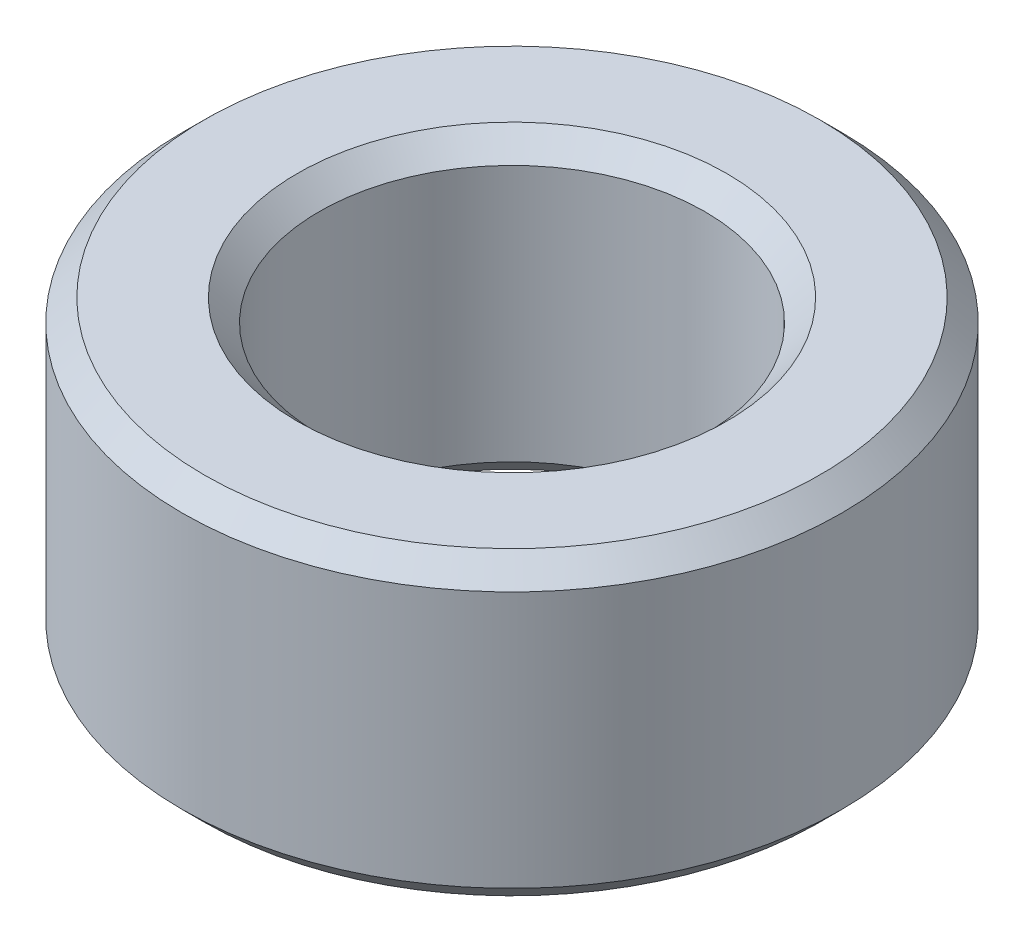
ISO-10303-21;
HEADER;
FILE_DESCRIPTION(('STEP AP214'),'2;1');
FILE_NAME('part.step','',(''),(''),'','','');
FILE_SCHEMA(('AUTOMOTIVE_DESIGN { 1 0 10303 214 1 1 1 1 }'));
ENDSEC;
DATA;
#1=APPLICATION_CONTEXT('core data for automotive mechanical design processes');
#2=APPLICATION_PROTOCOL_DEFINITION('international standard','automotive_design',2000,#1);
#3=PRODUCT_CONTEXT('',#1,'mechanical');
#4=PRODUCT('Part','Part','',(#3));
#5=PRODUCT_RELATED_PRODUCT_CATEGORY('part','',(#4));
#6=PRODUCT_DEFINITION_FORMATION('','',#4);
#7=PRODUCT_DEFINITION_CONTEXT('part definition',#1,'design');
#8=PRODUCT_DEFINITION('design','',#6,#7);
#9=PRODUCT_DEFINITION_SHAPE('','',#8);
#10=(LENGTH_UNIT() NAMED_UNIT(*) SI_UNIT(.MILLI.,.METRE.));
#11=(NAMED_UNIT(*) PLANE_ANGLE_UNIT() SI_UNIT($,.RADIAN.));
#12=(NAMED_UNIT(*) SI_UNIT($,.STERADIAN.) SOLID_ANGLE_UNIT());
#13=UNCERTAINTY_MEASURE_WITH_UNIT(LENGTH_MEASURE(1.E-05),#10,'distance_accuracy_value','');
#14=(GEOMETRIC_REPRESENTATION_CONTEXT(3) GLOBAL_UNCERTAINTY_ASSIGNED_CONTEXT((#13)) GLOBAL_UNIT_ASSIGNED_CONTEXT((#10,
#11,#12)) REPRESENTATION_CONTEXT('',''));
#15=CARTESIAN_POINT('',(0.,0.,0.));
#16=DIRECTION('',(0.,0.,1.));
#17=DIRECTION('',(1.,0.,0.));
#18=AXIS2_PLACEMENT_3D('',#15,#16,#17);
#19=CARTESIAN_POINT('',(0.,27.3592271309551,0.));
#20=DIRECTION('',(0.,-1.,0.));
#21=DIRECTION('',(0.,0.,-1.));
#22=AXIS2_PLACEMENT_3D('',#19,#20,#21);
#23=CYLINDRICAL_SURFACE('',#22,30.);
#24=CARTESIAN_POINT('',(0.,2.00002191290805,0.));
#25=DIRECTION('',(0.,1.,0.));
#26=DIRECTION('',(0.,0.,1.));
#27=AXIS2_PLACEMENT_3D('',#24,#25,#26);
#28=CIRCLE('',#27,30.);
#29=CARTESIAN_POINT('',(0.,2.00002191290805,-30.));
#30=VERTEX_POINT('',#29);
#31=EDGE_CURVE('E10',#30,#30,#28,.T.);
#32=CARTESIAN_POINT('',(0.,25.3592052180471,0.));
#33=DIRECTION('',(0.,1.,0.));
#34=DIRECTION('',(0.,0.,1.));
#35=AXIS2_PLACEMENT_3D('',#32,#33,#34);
#36=CIRCLE('',#35,30.);
#37=CARTESIAN_POINT('',(0.,25.3592052180471,-30.));
#38=VERTEX_POINT('',#37);
#39=EDGE_CURVE('E50',#38,#38,#36,.F.);
#40=CARTESIAN_POINT('',(0.,2.00002191290805,-30.));
#41=CARTESIAN_POINT('',(0.,2.24334673900325,-30.));
#42=CARTESIAN_POINT('',(0.,2.48667156509845,-30.));
#43=CARTESIAN_POINT('',(0.,2.97332121728884,-30.));
#44=CARTESIAN_POINT('',(0.,3.21664604338404,-30.));
#45=CARTESIAN_POINT('',(0.,3.70329569557444,-30.));
#46=CARTESIAN_POINT('',(0.,3.94662052166964,-30.));
#47=CARTESIAN_POINT('',(0.,4.43327017386003,-30.));
#48=CARTESIAN_POINT('',(0.,4.67659499995523,-30.));
#49=CARTESIAN_POINT('',(0.,5.16324465214563,-30.));
#50=CARTESIAN_POINT('',(0.,5.40656947824083,-30.));
#51=CARTESIAN_POINT('',(0.,5.89321913043122,-30.));
#52=CARTESIAN_POINT('',(0.,6.13654395652642,-30.));
#53=CARTESIAN_POINT('',(0.,6.62319360871682,-30.));
#54=CARTESIAN_POINT('',(0.,6.86651843481202,-30.));
#55=CARTESIAN_POINT('',(0.,7.35316808700241,-30.));
#56=CARTESIAN_POINT('',(0.,7.59649291309761,-30.));
#57=CARTESIAN_POINT('',(0.,8.08314256528801,-30.));
#58=CARTESIAN_POINT('',(0.,8.32646739138321,-30.));
#59=CARTESIAN_POINT('',(0.,8.8131170435736,-30.));
#60=CARTESIAN_POINT('',(0.,9.0564418696688,-30.));
#61=CARTESIAN_POINT('',(0.,9.5430915218592,-30.));
#62=CARTESIAN_POINT('',(0.,9.7864163479544,-30.));
#63=CARTESIAN_POINT('',(0.,10.2730660001448,-30.));
#64=CARTESIAN_POINT('',(0.,10.51639082624,-30.));
#65=CARTESIAN_POINT('',(0.,11.0030404784304,-30.));
#66=CARTESIAN_POINT('',(0.,11.2463653045256,-30.));
#67=CARTESIAN_POINT('',(0.,11.733014956716,-30.));
#68=CARTESIAN_POINT('',(0.,11.9763397828112,-30.));
#69=CARTESIAN_POINT('',(0.,12.4629894350016,-30.));
#70=CARTESIAN_POINT('',(0.,12.7063142610968,-30.));
#71=CARTESIAN_POINT('',(0.,13.1929639132872,-30.));
#72=CARTESIAN_POINT('',(0.,13.4362887393824,-30.));
#73=CARTESIAN_POINT('',(0.,13.9229383915728,-30.));
#74=CARTESIAN_POINT('',(0.,14.166263217668,-30.));
#75=CARTESIAN_POINT('',(0.,14.6529128698584,-30.));
#76=CARTESIAN_POINT('',(0.,14.8962376959536,-30.));
#77=CARTESIAN_POINT('',(0.,15.382887348144,-30.));
#78=CARTESIAN_POINT('',(0.,15.6262121742392,-30.));
#79=CARTESIAN_POINT('',(0.,16.1128618264296,-30.));
#80=CARTESIAN_POINT('',(0.,16.3561866525248,-30.));
#81=CARTESIAN_POINT('',(0.,16.8428363047151,-30.));
#82=CARTESIAN_POINT('',(0.,17.0861611308103,-30.));
#83=CARTESIAN_POINT('',(0.,17.5728107830007,-30.));
#84=CARTESIAN_POINT('',(0.,17.8161356090959,-30.));
#85=CARTESIAN_POINT('',(0.,18.3027852612863,-30.));
#86=CARTESIAN_POINT('',(0.,18.5461100873815,-30.));
#87=CARTESIAN_POINT('',(0.,19.0327597395719,-30.));
#88=CARTESIAN_POINT('',(0.,19.2760845656671,-30.));
#89=CARTESIAN_POINT('',(0.,19.7627342178575,-30.));
#90=CARTESIAN_POINT('',(0.,20.0060590439527,-30.));
#91=CARTESIAN_POINT('',(0.,20.4927086961431,-30.));
#92=CARTESIAN_POINT('',(0.,20.7360335222383,-30.));
#93=CARTESIAN_POINT('',(0.,21.2226831744287,-30.));
#94=CARTESIAN_POINT('',(0.,21.4660080005239,-30.));
#95=CARTESIAN_POINT('',(0.,21.9526576527143,-30.));
#96=CARTESIAN_POINT('',(0.,22.1959824788095,-30.));
#97=CARTESIAN_POINT('',(0.,22.6826321309999,-30.));
#98=CARTESIAN_POINT('',(0.,22.9259569570951,-30.));
#99=CARTESIAN_POINT('',(0.,23.4126066092855,-30.));
#100=CARTESIAN_POINT('',(0.,23.6559314353807,-30.));
#101=CARTESIAN_POINT('',(0.,24.1425810875711,-30.));
#102=CARTESIAN_POINT('',(0.,24.3859059136663,-30.));
#103=CARTESIAN_POINT('',(0.,24.8725555658567,-30.));
#104=CARTESIAN_POINT('',(0.,25.1158803919519,-30.));
#105=CARTESIAN_POINT('',(0.,25.3592052180471,-30.));
#106=B_SPLINE_CURVE_WITH_KNOTS('',3,(#40,#41,#42,#43,#44,#45,#46,#47,#48,#49,#50,#51,#52,#53,
#54,#55,#56,#57,#58,#59,#60,#61,#62,#63,#64,#65,#66,#67,#68,#69,#70,#71,#72,#73,#74,#75,#76,#77,
#78,#79,#80,#81,#82,#83,#84,#85,#86,#87,#88,#89,#90,#91,#92,#93,#94,#95,#96,#97,#98,#99,#100,
#101,#102,#103,#104,#105),.UNSPECIFIED.,.F.,.F.,(4,2,2,2,2,2,2,2,2,2,2,2,2,2,2,2,2,2,2,2,2,2,2,
2,2,2,2,2,2,2,2,2,4),(0.,0.729974478285596,1.45994895657119,2.18992343485679,2.91989791314238,
3.64987239142798,4.37984686971357,5.10982134799916,5.83979582628476,6.56977030457036,
7.29974478285595,8.02971926114155,8.75969373942714,9.48966821771274,10.2196426959983,
10.9496171742839,11.6795916525695,12.4095661308551,13.1395406091407,13.8695150874263,
14.5994895657119,15.3294640439975,16.0594385222831,16.7894130005687,17.5193874788543,
18.2493619571399,18.9793364354255,19.7093109137111,20.4392853919967,21.1692598702823,
21.8992343485679,22.6292088268534,23.359183305139),.UNSPECIFIED.);
#107=EDGE_CURVE('BSEAM39',#30,#38,#106,.T.);
#108=ORIENTED_EDGE('',*,*,#31,.T.);
#109=ORIENTED_EDGE('',*,*,#39,.T.);
#110=ORIENTED_EDGE('',*,*,#107,.T.);
#111=ORIENTED_EDGE('',*,*,#107,.F.);
#112=EDGE_LOOP('',(#108,#110,#109,#111));
#113=FACE_BOUND('',#112,.T.);
#114=ADVANCED_FACE('F39',(#113),#23,.T.);
#115=CARTESIAN_POINT('',(0.,27.3592271309551,0.));
#116=DIRECTION('',(0.,1.,0.));
#117=DIRECTION('',(0.,0.,1.));
#118=AXIS2_PLACEMENT_3D('',#115,#116,#117);
#119=PLANE('',#118);
#120=CARTESIAN_POINT('',(0.,27.3592271309551,0.));
#121=DIRECTION('',(0.,1.,0.));
#122=DIRECTION('',(0.,0.,1.));
#123=AXIS2_PLACEMENT_3D('',#120,#121,#122);
#124=CIRCLE('',#123,19.5370277556353);
#125=CARTESIAN_POINT('',(0.,27.3592271309551,19.5370277556353));
#126=VERTEX_POINT('',#125);
#127=EDGE_CURVE('E58',#126,#126,#124,.F.);
#128=ORIENTED_EDGE('',*,*,#127,.T.);
#129=EDGE_LOOP('',(#128));
#130=FACE_BOUND('',#129,.T.);
#131=CARTESIAN_POINT('',(0.,27.3592271309551,0.));
#132=DIRECTION('',(0.,1.,0.));
#133=DIRECTION('',(0.,0.,1.));
#134=AXIS2_PLACEMENT_3D('',#131,#132,#133);
#135=CIRCLE('',#134,27.999978087092);
#136=CARTESIAN_POINT('',(0.,27.3592271309551,27.999978087092));
#137=VERTEX_POINT('',#136);
#138=EDGE_CURVE('E61',#137,#137,#135,.T.);
#139=ORIENTED_EDGE('',*,*,#138,.T.);
#140=EDGE_LOOP('',(#139));
#141=FACE_BOUND('',#140,.T.);
#142=ADVANCED_FACE('F88',(#130,#141),#119,.T.);
#143=CARTESIAN_POINT('',(0.,0.,0.));
#144=DIRECTION('',(0.,1.,0.));
#145=DIRECTION('',(0.,0.,1.));
#146=AXIS2_PLACEMENT_3D('',#143,#144,#145);
#147=PLANE('',#146);
#148=CARTESIAN_POINT('',(0.,0.,0.));
#149=DIRECTION('',(0.,1.,0.));
#150=DIRECTION('',(0.,0.,1.));
#151=AXIS2_PLACEMENT_3D('',#148,#149,#150);
#152=CIRCLE('',#151,19.5370277556352);
#153=CARTESIAN_POINT('',(0.,0.,19.5370277556352));
#154=VERTEX_POINT('',#153);
#155=EDGE_CURVE('E51',#154,#154,#152,.T.);
#156=ORIENTED_EDGE('',*,*,#155,.T.);
#157=EDGE_LOOP('',(#156));
#158=FACE_BOUND('',#157,.T.);
#159=CARTESIAN_POINT('',(0.,0.,0.));
#160=DIRECTION('',(0.,1.,0.));
#161=DIRECTION('',(0.,0.,1.));
#162=AXIS2_PLACEMENT_3D('',#159,#160,#161);
#163=CIRCLE('',#162,27.9999780870919);
#164=CARTESIAN_POINT('',(0.,0.,27.9999780870919));
#165=VERTEX_POINT('',#164);
#166=EDGE_CURVE('E54',#165,#165,#163,.F.);
#167=ORIENTED_EDGE('',*,*,#166,.T.);
#168=EDGE_LOOP('',(#167));
#169=FACE_BOUND('',#168,.T.);
#170=ADVANCED_FACE('F83',(#158,#169),#147,.F.);
#171=CARTESIAN_POINT('',(0.,27.3592271309551,0.));
#172=DIRECTION('',(0.,-1.,0.));
#173=DIRECTION('',(0.,0.,-1.));
#174=AXIS2_PLACEMENT_3D('',#171,#172,#173);
#175=CYLINDRICAL_SURFACE('',#174,17.5370058427272);
#176=CARTESIAN_POINT('',(0.,25.359205218047,0.));
#177=DIRECTION('',(0.,1.,0.));
#178=DIRECTION('',(0.,0.,1.));
#179=AXIS2_PLACEMENT_3D('',#176,#177,#178);
#180=CIRCLE('',#179,17.5370058427272);
#181=CARTESIAN_POINT('',(0.,25.359205218047,-17.5370058427272));
#182=VERTEX_POINT('',#181);
#183=EDGE_CURVE('E67',#182,#182,#180,.T.);
#184=CARTESIAN_POINT('',(0.,2.00002191290799,0.));
#185=DIRECTION('',(0.,1.,0.));
#186=DIRECTION('',(0.,0.,1.));
#187=AXIS2_PLACEMENT_3D('',#184,#185,#186);
#188=CIRCLE('',#187,17.5370058427272);
#189=CARTESIAN_POINT('',(0.,2.00002191290799,-17.5370058427272));
#190=VERTEX_POINT('',#189);
#191=EDGE_CURVE('E69',#190,#190,#188,.F.);
#192=CARTESIAN_POINT('',(0.,25.359205218047,-17.5370058427272));
#193=CARTESIAN_POINT('',(0.,25.1158803919518,-17.5370058427272));
#194=CARTESIAN_POINT('',(0.,24.8725555658566,-17.5370058427272));
#195=CARTESIAN_POINT('',(0.,24.3859059136662,-17.5370058427272));
#196=CARTESIAN_POINT('',(0.,24.142581087571,-17.5370058427272));
#197=CARTESIAN_POINT('',(0.,23.6559314353806,-17.5370058427272));
#198=CARTESIAN_POINT('',(0.,23.4126066092854,-17.5370058427272));
#199=CARTESIAN_POINT('',(0.,22.925956957095,-17.5370058427272));
#200=CARTESIAN_POINT('',(0.,22.6826321309998,-17.5370058427272));
#201=CARTESIAN_POINT('',(0.,22.1959824788094,-17.5370058427272));
#202=CARTESIAN_POINT('',(0.,21.9526576527142,-17.5370058427272));
#203=CARTESIAN_POINT('',(0.,21.4660080005238,-17.5370058427272));
#204=CARTESIAN_POINT('',(0.,21.2226831744286,-17.5370058427272));
#205=CARTESIAN_POINT('',(0.,20.7360335222383,-17.5370058427272));
#206=CARTESIAN_POINT('',(0.,20.4927086961431,-17.5370058427272));
#207=CARTESIAN_POINT('',(0.,20.0060590439527,-17.5370058427272));
#208=CARTESIAN_POINT('',(0.,19.7627342178575,-17.5370058427272));
#209=CARTESIAN_POINT('',(0.,19.2760845656671,-17.5370058427272));
#210=CARTESIAN_POINT('',(0.,19.0327597395719,-17.5370058427272));
#211=CARTESIAN_POINT('',(0.,18.5461100873815,-17.5370058427272));
#212=CARTESIAN_POINT('',(0.,18.3027852612863,-17.5370058427272));
#213=CARTESIAN_POINT('',(0.,17.8161356090959,-17.5370058427272));
#214=CARTESIAN_POINT('',(0.,17.5728107830007,-17.5370058427272));
#215=CARTESIAN_POINT('',(0.,17.0861611308103,-17.5370058427272));
#216=CARTESIAN_POINT('',(0.,16.8428363047151,-17.5370058427272));
#217=CARTESIAN_POINT('',(0.,16.3561866525247,-17.5370058427272));
#218=CARTESIAN_POINT('',(0.,16.1128618264295,-17.5370058427272));
#219=CARTESIAN_POINT('',(0.,15.6262121742391,-17.5370058427272));
#220=CARTESIAN_POINT('',(0.,15.3828873481439,-17.5370058427272));
#221=CARTESIAN_POINT('',(0.,14.8962376959535,-17.5370058427272));
#222=CARTESIAN_POINT('',(0.,14.6529128698583,-17.5370058427272));
#223=CARTESIAN_POINT('',(0.,14.1662632176679,-17.5370058427272));
#224=CARTESIAN_POINT('',(0.,13.9229383915727,-17.5370058427272));
#225=CARTESIAN_POINT('',(0.,13.4362887393823,-17.5370058427272));
#226=CARTESIAN_POINT('',(0.,13.1929639132871,-17.5370058427272));
#227=CARTESIAN_POINT('',(0.,12.7063142610967,-17.5370058427272));
#228=CARTESIAN_POINT('',(0.,12.4629894350015,-17.5370058427272));
#229=CARTESIAN_POINT('',(0.,11.9763397828111,-17.5370058427272));
#230=CARTESIAN_POINT('',(0.,11.7330149567159,-17.5370058427272));
#231=CARTESIAN_POINT('',(0.,11.2463653045255,-17.5370058427272));
#232=CARTESIAN_POINT('',(0.,11.0030404784303,-17.5370058427272));
#233=CARTESIAN_POINT('',(0.,10.5163908262399,-17.5370058427272));
#234=CARTESIAN_POINT('',(0.,10.2730660001447,-17.5370058427272));
#235=CARTESIAN_POINT('',(0.,9.78641634795433,-17.5370058427272));
#236=CARTESIAN_POINT('',(0.,9.54309152185913,-17.5370058427272));
#237=CARTESIAN_POINT('',(0.,9.05644186966874,-17.5370058427272));
#238=CARTESIAN_POINT('',(0.,8.81311704357354,-17.5370058427272));
#239=CARTESIAN_POINT('',(0.,8.32646739138314,-17.5370058427272));
#240=CARTESIAN_POINT('',(0.,8.08314256528794,-17.5370058427272));
#241=CARTESIAN_POINT('',(0.,7.59649291309755,-17.5370058427272));
#242=CARTESIAN_POINT('',(0.,7.35316808700235,-17.5370058427272));
#243=CARTESIAN_POINT('',(0.,6.86651843481195,-17.5370058427272));
#244=CARTESIAN_POINT('',(0.,6.62319360871675,-17.5370058427272));
#245=CARTESIAN_POINT('',(0.,6.13654395652636,-17.5370058427272));
#246=CARTESIAN_POINT('',(0.,5.89321913043116,-17.5370058427272));
#247=CARTESIAN_POINT('',(0.,5.40656947824076,-17.5370058427272));
#248=CARTESIAN_POINT('',(0.,5.16324465214556,-17.5370058427272));
#249=CARTESIAN_POINT('',(0.,4.67659499995517,-17.5370058427272));
#250=CARTESIAN_POINT('',(0.,4.43327017385997,-17.5370058427272));
#251=CARTESIAN_POINT('',(0.,3.94662052166957,-17.5370058427272));
#252=CARTESIAN_POINT('',(0.,3.70329569557437,-17.5370058427272));
#253=CARTESIAN_POINT('',(0.,3.21664604338398,-17.5370058427272));
#254=CARTESIAN_POINT('',(0.,2.97332121728878,-17.5370058427272));
#255=CARTESIAN_POINT('',(0.,2.48667156509838,-17.5370058427272));
#256=CARTESIAN_POINT('',(0.,2.24334673900319,-17.5370058427272));
#257=CARTESIAN_POINT('',(0.,2.00002191290799,-17.5370058427272));
#258=B_SPLINE_CURVE_WITH_KNOTS('',3,(#192,#193,#194,#195,#196,#197,#198,#199,#200,#201,#202,
#203,#204,#205,#206,#207,#208,#209,#210,#211,#212,#213,#214,#215,#216,#217,#218,#219,#220,#221,
#222,#223,#224,#225,#226,#227,#228,#229,#230,#231,#232,#233,#234,#235,#236,#237,#238,#239,#240,
#241,#242,#243,#244,#245,#246,#247,#248,#249,#250,#251,#252,#253,#254,#255,#256,#257),
.UNSPECIFIED.,.F.,.F.,(4,2,2,2,2,2,2,2,2,2,2,2,2,2,2,2,2,2,2,2,2,2,2,2,2,2,2,2,2,2,2,2,4),(0.,
0.729974478285593,1.45994895657119,2.18992343485678,2.91989791314238,3.64987239142797,
4.37984686971357,5.10982134799916,5.83979582628475,6.56977030457035,7.29974478285595,
8.02971926114154,8.75969373942713,9.48966821771273,10.2196426959983,10.9496171742839,
11.6795916525695,12.4095661308551,13.1395406091407,13.8695150874263,14.5994895657119,
15.3294640439975,16.0594385222831,16.7894130005687,17.5193874788543,18.2493619571399,
18.9793364354255,19.7093109137111,20.4392853919967,21.1692598702822,21.8992343485678,
22.6292088268534,23.359183305139),.UNSPECIFIED.);
#259=EDGE_CURVE('BSEAM71',#182,#190,#258,.T.);
#260=ORIENTED_EDGE('',*,*,#183,.T.);
#261=ORIENTED_EDGE('',*,*,#191,.T.);
#262=ORIENTED_EDGE('',*,*,#259,.T.);
#263=ORIENTED_EDGE('',*,*,#259,.F.);
#264=EDGE_LOOP('',(#260,#262,#261,#263));
#265=FACE_BOUND('',#264,.T.);
#266=ADVANCED_FACE('F71',(#265),#175,.F.);
#267=CARTESIAN_POINT('',(0.,25.359205218047,0.));
#268=DIRECTION('',(0.,1.,0.));
#269=DIRECTION('',(0.,0.,1.));
#270=AXIS2_PLACEMENT_3D('',#267,#268,#269);
#271=CONICAL_SURFACE('',#270,17.5370058427272,0.785398163397449);
#272=ORIENTED_EDGE('',*,*,#127,.F.);
#273=EDGE_LOOP('',(#272));
#274=FACE_BOUND('',#273,.T.);
#275=ORIENTED_EDGE('',*,*,#183,.F.);
#276=EDGE_LOOP('',(#275));
#277=FACE_BOUND('',#276,.T.);
#278=ADVANCED_FACE('F77',(#274,#277),#271,.F.);
#279=CARTESIAN_POINT('',(0.,0.,0.));
#280=DIRECTION('',(0.,-1.,0.));
#281=DIRECTION('',(0.,0.,-1.));
#282=AXIS2_PLACEMENT_3D('',#279,#280,#281);
#283=CONICAL_SURFACE('',#282,19.5370277556352,0.785398163397446);
#284=ORIENTED_EDGE('',*,*,#191,.F.);
#285=EDGE_LOOP('',(#284));
#286=FACE_BOUND('',#285,.T.);
#287=ORIENTED_EDGE('',*,*,#155,.F.);
#288=EDGE_LOOP('',(#287));
#289=FACE_BOUND('',#288,.T.);
#290=ADVANCED_FACE('F73',(#286,#289),#283,.F.);
#291=CARTESIAN_POINT('',(0.,2.00002191290805,0.));
#292=DIRECTION('',(0.,1.,0.));
#293=DIRECTION('',(0.,0.,1.));
#294=AXIS2_PLACEMENT_3D('',#291,#292,#293);
#295=CONICAL_SURFACE('',#294,30.,0.785398163397448);
#296=ORIENTED_EDGE('',*,*,#166,.F.);
#297=EDGE_LOOP('',(#296));
#298=FACE_BOUND('',#297,.T.);
#299=ORIENTED_EDGE('',*,*,#31,.F.);
#300=EDGE_LOOP('',(#299));
#301=FACE_BOUND('',#300,.T.);
#302=ADVANCED_FACE('F76',(#298,#301),#295,.T.);
#303=CARTESIAN_POINT('',(0.,27.3592271309551,0.));
#304=DIRECTION('',(0.,-1.,0.));
#305=DIRECTION('',(0.,0.,-1.));
#306=AXIS2_PLACEMENT_3D('',#303,#304,#305);
#307=CONICAL_SURFACE('',#306,27.999978087092,0.785398163397445);
#308=ORIENTED_EDGE('',*,*,#39,.F.);
#309=EDGE_LOOP('',(#308));
#310=FACE_BOUND('',#309,.T.);
#311=ORIENTED_EDGE('',*,*,#138,.F.);
#312=EDGE_LOOP('',(#311));
#313=FACE_BOUND('',#312,.T.);
#314=ADVANCED_FACE('F45',(#310,#313),#307,.T.);
#315=CLOSED_SHELL('',(#114,#142,#170,#266,#278,#290,#302,#314));
#316=MANIFOLD_SOLID_BREP('B2',#315);
#317=ADVANCED_BREP_SHAPE_REPRESENTATION('',(#18,#316),#14);
#318=SHAPE_DEFINITION_REPRESENTATION(#9,#317);
ENDSEC;
END-ISO-10303-21;
